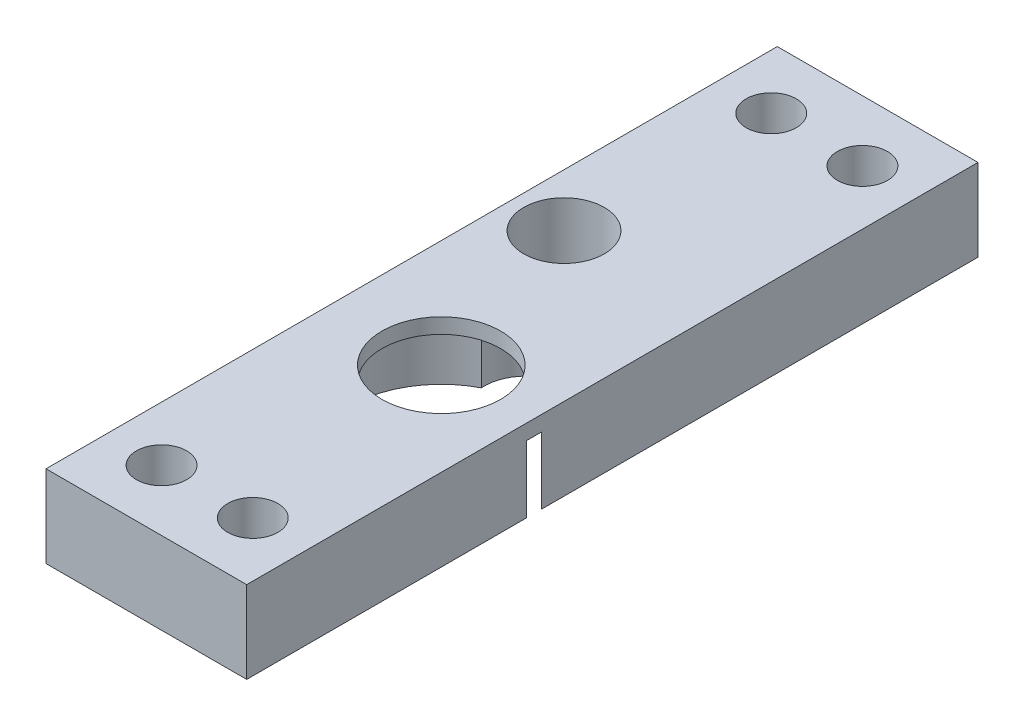
ISO-10303-21;
HEADER;
FILE_DESCRIPTION(('STEP AP214'),'2;1');
FILE_NAME('part.step','',(''),(''),'','','');
FILE_SCHEMA(('AUTOMOTIVE_DESIGN { 1 0 10303 214 1 1 1 1 }'));
ENDSEC;
DATA;
#1=APPLICATION_CONTEXT('core data for automotive mechanical design processes');
#2=APPLICATION_PROTOCOL_DEFINITION('international standard','automotive_design',2000,#1);
#3=PRODUCT_CONTEXT('',#1,'mechanical');
#4=PRODUCT('Part','Part','',(#3));
#5=PRODUCT_RELATED_PRODUCT_CATEGORY('part','',(#4));
#6=PRODUCT_DEFINITION_FORMATION('','',#4);
#7=PRODUCT_DEFINITION_CONTEXT('part definition',#1,'design');
#8=PRODUCT_DEFINITION('design','',#6,#7);
#9=PRODUCT_DEFINITION_SHAPE('','',#8);
#10=(LENGTH_UNIT() NAMED_UNIT(*) SI_UNIT(.MILLI.,.METRE.));
#11=(NAMED_UNIT(*) PLANE_ANGLE_UNIT() SI_UNIT($,.RADIAN.));
#12=(NAMED_UNIT(*) SI_UNIT($,.STERADIAN.) SOLID_ANGLE_UNIT());
#13=UNCERTAINTY_MEASURE_WITH_UNIT(LENGTH_MEASURE(1.E-05),#10,'distance_accuracy_value','');
#14=(GEOMETRIC_REPRESENTATION_CONTEXT(3) GLOBAL_UNCERTAINTY_ASSIGNED_CONTEXT((#13)) GLOBAL_UNIT_ASSIGNED_CONTEXT((#10,
#11,#12)) REPRESENTATION_CONTEXT('',''));
#15=CARTESIAN_POINT('',(0.,0.,0.));
#16=DIRECTION('',(0.,0.,1.));
#17=DIRECTION('',(1.,0.,0.));
#18=AXIS2_PLACEMENT_3D('',#15,#16,#17);
#19=CARTESIAN_POINT('',(2.47060611120811,0.4,-17.8));
#20=DIRECTION('',(0.,1.,0.));
#21=DIRECTION('',(0.,0.,1.));
#22=AXIS2_PLACEMENT_3D('',#19,#20,#21);
#23=CYLINDRICAL_SURFACE('',#22,2.65);
#24=CARTESIAN_POINT('',(2.47060611120811,0.4,-17.8));
#25=DIRECTION('',(0.,1.,0.));
#26=DIRECTION('',(0.,0.,1.));
#27=AXIS2_PLACEMENT_3D('',#24,#25,#26);
#28=CIRCLE('',#27,2.65);
#29=CARTESIAN_POINT('',(2.47060611120811,0.4,-15.15));
#30=VERTEX_POINT('',#29);
#31=EDGE_CURVE('E236',#30,#30,#28,.T.);
#32=ORIENTED_EDGE('',*,*,#31,.F.);
#33=EDGE_LOOP('',(#32));
#34=FACE_BOUND('',#33,.T.);
#35=CARTESIAN_POINT('',(2.47060611120811,5.4,-17.8));
#36=DIRECTION('',(0.,1.,0.));
#37=DIRECTION('',(0.,0.,1.));
#38=AXIS2_PLACEMENT_3D('',#35,#36,#37);
#39=CIRCLE('',#38,2.65);
#40=CARTESIAN_POINT('',(2.47060611120811,5.4,-15.15));
#41=VERTEX_POINT('',#40);
#42=EDGE_CURVE('E222',#41,#41,#39,.T.);
#43=ORIENTED_EDGE('',*,*,#42,.T.);
#44=EDGE_LOOP('',(#43));
#45=FACE_BOUND('',#44,.T.);
#46=ADVANCED_FACE('F47',(#34,#45),#23,.F.);
#47=CARTESIAN_POINT('',(2.47060611120811,0.4,-17.8));
#48=DIRECTION('',(0.,1.,0.));
#49=DIRECTION('',(0.,0.,1.));
#50=AXIS2_PLACEMENT_3D('',#47,#48,#49);
#51=PLANE('',#50);
#52=ORIENTED_EDGE('',*,*,#31,.T.);
#53=EDGE_LOOP('',(#52));
#54=FACE_BOUND('',#53,.T.);
#55=ADVANCED_FACE('F332',(#54),#51,.T.);
#56=CARTESIAN_POINT('',(0.,5.4,0.));
#57=DIRECTION('',(0.,1.,0.));
#58=DIRECTION('',(0.,0.,1.));
#59=AXIS2_PLACEMENT_3D('',#56,#57,#58);
#60=PLANE('',#59);
#61=ORIENTED_EDGE('',*,*,#42,.F.);
#62=EDGE_LOOP('',(#61));
#63=FACE_BOUND('',#62,.T.);
#64=DIRECTION('',(0.,0.,1.));
#65=VECTOR('',#64,1.);
#66=CARTESIAN_POINT('',(-1.,5.4,-27.3));
#67=LINE('',#66,#65);
#68=CARTESIAN_POINT('',(-1.,5.4,-35.3));
#69=VERTEX_POINT('',#68);
#70=CARTESIAN_POINT('',(-0.999999999999995,5.4,12.8));
#71=VERTEX_POINT('',#70);
#72=EDGE_CURVE('E230',#69,#71,#67,.T.);
#73=ORIENTED_EDGE('',*,*,#72,.T.);
#74=DIRECTION('',(1.,0.,0.));
#75=VECTOR('',#74,1.);
#76=CARTESIAN_POINT('',(-0.999999999999995,5.4,12.8));
#77=LINE('',#76,#75);
#78=CARTESIAN_POINT('',(12.2,5.4,12.8));
#79=VERTEX_POINT('',#78);
#80=EDGE_CURVE('E213',#71,#79,#77,.T.);
#81=ORIENTED_EDGE('',*,*,#80,.T.);
#82=DIRECTION('',(0.,0.,-1.));
#83=VECTOR('',#82,1.);
#84=CARTESIAN_POINT('',(12.2,5.4,-27.3));
#85=LINE('',#84,#83);
#86=CARTESIAN_POINT('',(12.2,5.4,-35.3));
#87=VERTEX_POINT('',#86);
#88=EDGE_CURVE('E181',#79,#87,#85,.T.);
#89=ORIENTED_EDGE('',*,*,#88,.T.);
#90=DIRECTION('',(-1.,0.,0.));
#91=VECTOR('',#90,1.);
#92=CARTESIAN_POINT('',(-1.,5.4,-35.3));
#93=LINE('',#92,#91);
#94=EDGE_CURVE('E284',#87,#69,#93,.T.);
#95=ORIENTED_EDGE('',*,*,#94,.T.);
#96=EDGE_LOOP('',(#73,#81,#89,#95));
#97=FACE_BOUND('',#96,.T.);
#98=CARTESIAN_POINT('',(6.1,5.4,-6.1));
#99=DIRECTION('',(0.,1.,0.));
#100=DIRECTION('',(0.,0.,1.));
#101=AXIS2_PLACEMENT_3D('',#98,#99,#100);
#102=CIRCLE('',#101,3.9);
#103=CARTESIAN_POINT('',(6.1,5.4,-2.2));
#104=VERTEX_POINT('',#103);
#105=EDGE_CURVE('E218',#104,#104,#102,.T.);
#106=ORIENTED_EDGE('',*,*,#105,.F.);
#107=EDGE_LOOP('',(#106));
#108=FACE_BOUND('',#107,.T.);
#109=CARTESIAN_POINT('',(2.6,5.4,8.8));
#110=DIRECTION('',(0.,1.,0.));
#111=DIRECTION('',(0.,0.,1.));
#112=AXIS2_PLACEMENT_3D('',#109,#110,#111);
#113=CIRCLE('',#112,1.65);
#114=CARTESIAN_POINT('',(2.6,5.4,10.45));
#115=VERTEX_POINT('',#114);
#116=EDGE_CURVE('E204',#115,#115,#113,.T.);
#117=ORIENTED_EDGE('',*,*,#116,.F.);
#118=EDGE_LOOP('',(#117));
#119=FACE_BOUND('',#118,.T.);
#120=CARTESIAN_POINT('',(8.6,5.4,8.8));
#121=DIRECTION('',(0.,1.,0.));
#122=DIRECTION('',(0.,0.,1.));
#123=AXIS2_PLACEMENT_3D('',#120,#121,#122);
#124=CIRCLE('',#123,1.65);
#125=CARTESIAN_POINT('',(8.6,5.4,10.45));
#126=VERTEX_POINT('',#125);
#127=EDGE_CURVE('E208',#126,#126,#124,.T.);
#128=ORIENTED_EDGE('',*,*,#127,.F.);
#129=EDGE_LOOP('',(#128));
#130=FACE_BOUND('',#129,.T.);
#131=CARTESIAN_POINT('',(2.6,5.4,-31.3));
#132=DIRECTION('',(0.,1.,0.));
#133=DIRECTION('',(0.,0.,1.));
#134=AXIS2_PLACEMENT_3D('',#131,#132,#133);
#135=CIRCLE('',#134,1.65);
#136=CARTESIAN_POINT('',(2.6,5.4,-29.65));
#137=VERTEX_POINT('',#136);
#138=EDGE_CURVE('E209',#137,#137,#135,.T.);
#139=ORIENTED_EDGE('',*,*,#138,.F.);
#140=EDGE_LOOP('',(#139));
#141=FACE_BOUND('',#140,.T.);
#142=CARTESIAN_POINT('',(8.6,5.4,-31.3));
#143=DIRECTION('',(0.,1.,0.));
#144=DIRECTION('',(0.,0.,1.));
#145=AXIS2_PLACEMENT_3D('',#142,#143,#144);
#146=CIRCLE('',#145,1.65);
#147=CARTESIAN_POINT('',(8.6,5.4,-29.65));
#148=VERTEX_POINT('',#147);
#149=EDGE_CURVE('E280',#148,#148,#146,.T.);
#150=ORIENTED_EDGE('',*,*,#149,.F.);
#151=EDGE_LOOP('',(#150));
#152=FACE_BOUND('',#151,.T.);
#153=ADVANCED_FACE('F302',(#63,#97,#108,#119,#130,#141,#152),#60,.T.);
#154=CARTESIAN_POINT('',(0.,4.4,0.));
#155=DIRECTION('',(0.,1.,0.));
#156=DIRECTION('',(0.,0.,1.));
#157=AXIS2_PLACEMENT_3D('',#154,#155,#156);
#158=PLANE('',#157);
#159=CARTESIAN_POINT('',(6.1,4.4,-6.1));
#160=DIRECTION('',(0.,1.,0.));
#161=DIRECTION('',(0.,0.,1.));
#162=AXIS2_PLACEMENT_3D('',#159,#160,#161);
#163=CIRCLE('',#162,6.1);
#164=CARTESIAN_POINT('',(12.1794736614283,4.4,-6.6));
#165=VERTEX_POINT('',#164);
#166=CARTESIAN_POINT('',(8.89435687149209,4.4,-11.5223214285714));
#167=VERTEX_POINT('',#166);
#168=EDGE_CURVE('E115',#165,#167,#163,.T.);
#169=ORIENTED_EDGE('',*,*,#168,.F.);
#170=DIRECTION('',(1.,0.,0.));
#171=VECTOR('',#170,1.);
#172=CARTESIAN_POINT('',(0.,4.4,-6.6));
#173=LINE('',#172,#171);
#174=CARTESIAN_POINT('',(12.2,4.4,-6.6));
#175=VERTEX_POINT('',#174);
#176=EDGE_CURVE('E119',#165,#175,#173,.T.);
#177=ORIENTED_EDGE('',*,*,#176,.T.);
#178=DIRECTION('',(0.,0.,-1.));
#179=VECTOR('',#178,1.);
#180=CARTESIAN_POINT('',(12.2,4.4,-27.3));
#181=LINE('',#180,#179);
#182=CARTESIAN_POINT('',(12.2,4.4,-5.6));
#183=VERTEX_POINT('',#182);
#184=EDGE_CURVE('E145',#183,#175,#181,.T.);
#185=ORIENTED_EDGE('',*,*,#184,.F.);
#186=DIRECTION('',(1.,0.,0.));
#187=VECTOR('',#186,1.);
#188=CARTESIAN_POINT('',(-2.36633811517809E-13,4.4,-5.59999999999948));
#189=LINE('',#188,#187);
#190=CARTESIAN_POINT('',(12.1794736614283,4.4,-5.6));
#191=VERTEX_POINT('',#190);
#192=EDGE_CURVE('E174',#191,#183,#189,.T.);
#193=ORIENTED_EDGE('',*,*,#192,.F.);
#194=CARTESIAN_POINT('',(6.1,4.4,-6.1));
#195=DIRECTION('',(0.,1.,0.));
#196=DIRECTION('',(0.,0.,1.));
#197=AXIS2_PLACEMENT_3D('',#194,#195,#196);
#198=CIRCLE('',#197,6.1);
#199=CARTESIAN_POINT('',(3.30564312850791,4.4,-11.5223214285714));
#200=VERTEX_POINT('',#199);
#201=EDGE_CURVE('E64',#200,#191,#198,.T.);
#202=ORIENTED_EDGE('',*,*,#201,.F.);
#203=CARTESIAN_POINT('',(6.1,4.4,-11.7));
#204=DIRECTION('',(0.,1.,0.));
#205=DIRECTION('',(0.,0.,1.));
#206=AXIS2_PLACEMENT_3D('',#203,#204,#205);
#207=CIRCLE('',#206,2.8);
#208=EDGE_CURVE('E92',#167,#200,#207,.T.);
#209=ORIENTED_EDGE('',*,*,#208,.F.);
#210=EDGE_LOOP('',(#169,#177,#185,#193,#202,#209));
#211=FACE_BOUND('',#210,.T.);
#212=CARTESIAN_POINT('',(6.1,4.4,-6.1));
#213=DIRECTION('',(0.,1.,0.));
#214=DIRECTION('',(0.,0.,1.));
#215=AXIS2_PLACEMENT_3D('',#212,#213,#214);
#216=CIRCLE('',#215,3.9);
#217=CARTESIAN_POINT('',(6.1,4.4,-2.2));
#218=VERTEX_POINT('',#217);
#219=EDGE_CURVE('E223',#218,#218,#216,.T.);
#220=ORIENTED_EDGE('',*,*,#219,.T.);
#221=EDGE_LOOP('',(#220));
#222=FACE_BOUND('',#221,.T.);
#223=ADVANCED_FACE('F320',(#211,#222),#158,.F.);
#224=CARTESIAN_POINT('',(6.1,5.4,-6.1));
#225=DIRECTION('',(0.,-1.,0.));
#226=DIRECTION('',(0.,0.,-1.));
#227=AXIS2_PLACEMENT_3D('',#224,#225,#226);
#228=CYLINDRICAL_SURFACE('',#227,3.9);
#229=ORIENTED_EDGE('',*,*,#105,.T.);
#230=EDGE_LOOP('',(#229));
#231=FACE_BOUND('',#230,.T.);
#232=ORIENTED_EDGE('',*,*,#219,.F.);
#233=EDGE_LOOP('',(#232));
#234=FACE_BOUND('',#233,.T.);
#235=ADVANCED_FACE('F260',(#231,#234),#228,.F.);
#236=CARTESIAN_POINT('',(0.,0.,0.));
#237=DIRECTION('',(0.,1.,0.));
#238=DIRECTION('',(0.,0.,1.));
#239=AXIS2_PLACEMENT_3D('',#236,#237,#238);
#240=PLANE('',#239);
#241=CARTESIAN_POINT('',(6.1,0.,-6.1));
#242=DIRECTION('',(0.,1.,0.));
#243=DIRECTION('',(0.,0.,1.));
#244=AXIS2_PLACEMENT_3D('',#241,#242,#243);
#245=CIRCLE('',#244,6.1);
#246=CARTESIAN_POINT('',(12.1794736614283,0.,-6.6));
#247=VERTEX_POINT('',#246);
#248=CARTESIAN_POINT('',(8.89435687149209,0.,-11.5223214285714));
#249=VERTEX_POINT('',#248);
#250=EDGE_CURVE('E113',#247,#249,#245,.T.);
#251=ORIENTED_EDGE('',*,*,#250,.T.);
#252=CARTESIAN_POINT('',(6.1,0.,-11.7));
#253=DIRECTION('',(0.,1.,0.));
#254=DIRECTION('',(0.,0.,1.));
#255=AXIS2_PLACEMENT_3D('',#252,#253,#254);
#256=CIRCLE('',#255,2.8);
#257=CARTESIAN_POINT('',(3.30564312850791,0.,-11.5223214285714));
#258=VERTEX_POINT('',#257);
#259=EDGE_CURVE('E91',#249,#258,#256,.T.);
#260=ORIENTED_EDGE('',*,*,#259,.T.);
#261=CARTESIAN_POINT('',(6.1,0.,-6.1));
#262=DIRECTION('',(0.,1.,0.));
#263=DIRECTION('',(0.,0.,1.));
#264=AXIS2_PLACEMENT_3D('',#261,#262,#263);
#265=CIRCLE('',#264,6.1);
#266=CARTESIAN_POINT('',(12.1794736614283,0.,-5.6));
#267=VERTEX_POINT('',#266);
#268=EDGE_CURVE('E99',#258,#267,#265,.T.);
#269=ORIENTED_EDGE('',*,*,#268,.T.);
#270=DIRECTION('',(1.,0.,0.));
#271=VECTOR('',#270,1.);
#272=CARTESIAN_POINT('',(-2.36633811517809E-13,0.,-5.59999999999948));
#273=LINE('',#272,#271);
#274=CARTESIAN_POINT('',(12.2,0.,-5.6));
#275=VERTEX_POINT('',#274);
#276=EDGE_CURVE('E106',#267,#275,#273,.T.);
#277=ORIENTED_EDGE('',*,*,#276,.T.);
#278=DIRECTION('',(0.,0.,-1.));
#279=VECTOR('',#278,1.);
#280=CARTESIAN_POINT('',(12.2,0.,0.));
#281=LINE('',#280,#279);
#282=CARTESIAN_POINT('',(12.2,0.,12.8));
#283=VERTEX_POINT('',#282);
#284=EDGE_CURVE('E158',#283,#275,#281,.T.);
#285=ORIENTED_EDGE('',*,*,#284,.F.);
#286=DIRECTION('',(-1.,0.,0.));
#287=VECTOR('',#286,1.);
#288=CARTESIAN_POINT('',(-0.999999999999995,0.,12.8));
#289=LINE('',#288,#287);
#290=CARTESIAN_POINT('',(-0.999999999999995,0.,12.8));
#291=VERTEX_POINT('',#290);
#292=EDGE_CURVE('E188',#283,#291,#289,.T.);
#293=ORIENTED_EDGE('',*,*,#292,.T.);
#294=DIRECTION('',(0.,0.,-1.));
#295=VECTOR('',#294,1.);
#296=CARTESIAN_POINT('',(-1.,0.,0.));
#297=LINE('',#296,#295);
#298=CARTESIAN_POINT('',(-1.,0.,-35.3));
#299=VERTEX_POINT('',#298);
#300=EDGE_CURVE('E154',#291,#299,#297,.T.);
#301=ORIENTED_EDGE('',*,*,#300,.T.);
#302=DIRECTION('',(1.,0.,0.));
#303=VECTOR('',#302,1.);
#304=CARTESIAN_POINT('',(-1.,0.,-35.3));
#305=LINE('',#304,#303);
#306=CARTESIAN_POINT('',(12.2,0.,-35.3));
#307=VERTEX_POINT('',#306);
#308=EDGE_CURVE('E151',#299,#307,#305,.T.);
#309=ORIENTED_EDGE('',*,*,#308,.T.);
#310=DIRECTION('',(0.,0.,-1.));
#311=VECTOR('',#310,1.);
#312=CARTESIAN_POINT('',(12.2,0.,0.));
#313=LINE('',#312,#311);
#314=CARTESIAN_POINT('',(12.2,0.,-6.6));
#315=VERTEX_POINT('',#314);
#316=EDGE_CURVE('E140',#315,#307,#313,.T.);
#317=ORIENTED_EDGE('',*,*,#316,.F.);
#318=DIRECTION('',(1.,0.,0.));
#319=VECTOR('',#318,1.);
#320=CARTESIAN_POINT('',(0.,0.,-6.6));
#321=LINE('',#320,#319);
#322=EDGE_CURVE('E148',#247,#315,#321,.T.);
#323=ORIENTED_EDGE('',*,*,#322,.F.);
#324=EDGE_LOOP('',(#251,#260,#269,#277,#285,#293,#301,#309,#317,#323));
#325=FACE_BOUND('',#324,.T.);
#326=CARTESIAN_POINT('',(2.6,0.,8.8));
#327=DIRECTION('',(0.,1.,0.));
#328=DIRECTION('',(0.,0.,1.));
#329=AXIS2_PLACEMENT_3D('',#326,#327,#328);
#330=CIRCLE('',#329,1.65);
#331=CARTESIAN_POINT('',(2.6,0.,10.45));
#332=VERTEX_POINT('',#331);
#333=EDGE_CURVE('E195',#332,#332,#330,.F.);
#334=ORIENTED_EDGE('',*,*,#333,.F.);
#335=EDGE_LOOP('',(#334));
#336=FACE_BOUND('',#335,.T.);
#337=CARTESIAN_POINT('',(8.6,0.,8.8));
#338=DIRECTION('',(0.,1.,0.));
#339=DIRECTION('',(0.,0.,1.));
#340=AXIS2_PLACEMENT_3D('',#337,#338,#339);
#341=CIRCLE('',#340,1.65);
#342=CARTESIAN_POINT('',(8.6,0.,10.45));
#343=VERTEX_POINT('',#342);
#344=EDGE_CURVE('E199',#343,#343,#341,.F.);
#345=ORIENTED_EDGE('',*,*,#344,.F.);
#346=EDGE_LOOP('',(#345));
#347=FACE_BOUND('',#346,.T.);
#348=CARTESIAN_POINT('',(2.6,0.,-31.3));
#349=DIRECTION('',(0.,1.,0.));
#350=DIRECTION('',(0.,0.,1.));
#351=AXIS2_PLACEMENT_3D('',#348,#349,#350);
#352=CIRCLE('',#351,1.65);
#353=CARTESIAN_POINT('',(2.6,0.,-29.65));
#354=VERTEX_POINT('',#353);
#355=EDGE_CURVE('E265',#354,#354,#352,.F.);
#356=ORIENTED_EDGE('',*,*,#355,.F.);
#357=EDGE_LOOP('',(#356));
#358=FACE_BOUND('',#357,.T.);
#359=CARTESIAN_POINT('',(8.6,0.,-31.3));
#360=DIRECTION('',(0.,1.,0.));
#361=DIRECTION('',(0.,0.,1.));
#362=AXIS2_PLACEMENT_3D('',#359,#360,#361);
#363=CIRCLE('',#362,1.65);
#364=CARTESIAN_POINT('',(8.6,0.,-29.65));
#365=VERTEX_POINT('',#364);
#366=EDGE_CURVE('E268',#365,#365,#363,.F.);
#367=ORIENTED_EDGE('',*,*,#366,.F.);
#368=EDGE_LOOP('',(#367));
#369=FACE_BOUND('',#368,.T.);
#370=ADVANCED_FACE('F109',(#325,#336,#347,#358,#369),#240,.F.);
#371=CARTESIAN_POINT('',(6.1,4.4,-11.7));
#372=DIRECTION('',(0.,-1.,0.));
#373=DIRECTION('',(0.,0.,-1.));
#374=AXIS2_PLACEMENT_3D('',#371,#372,#373);
#375=CYLINDRICAL_SURFACE('',#374,2.8);
#376=ORIENTED_EDGE('',*,*,#259,.F.);
#377=DIRECTION('',(0.,-1.,0.));
#378=VECTOR('',#377,1.);
#379=CARTESIAN_POINT('',(8.89435687149209,4.4,-11.5223214285714));
#380=LINE('',#379,#378);
#381=EDGE_CURVE('E96',#167,#249,#380,.T.);
#382=ORIENTED_EDGE('',*,*,#381,.F.);
#383=ORIENTED_EDGE('',*,*,#208,.T.);
#384=DIRECTION('',(0.,-1.,0.));
#385=VECTOR('',#384,1.);
#386=CARTESIAN_POINT('',(3.30564312850791,4.4,-11.5223214285714));
#387=LINE('',#386,#385);
#388=EDGE_CURVE('E86',#200,#258,#387,.T.);
#389=ORIENTED_EDGE('',*,*,#388,.T.);
#390=EDGE_LOOP('',(#376,#382,#383,#389));
#391=FACE_BOUND('',#390,.T.);
#392=ADVANCED_FACE('F88',(#391),#375,.F.);
#393=CARTESIAN_POINT('',(6.1,4.4,-6.1));
#394=DIRECTION('',(0.,-1.,0.));
#395=DIRECTION('',(0.,0.,-1.));
#396=AXIS2_PLACEMENT_3D('',#393,#394,#395);
#397=CYLINDRICAL_SURFACE('',#396,6.1);
#398=ORIENTED_EDGE('',*,*,#268,.F.);
#399=ORIENTED_EDGE('',*,*,#388,.F.);
#400=ORIENTED_EDGE('',*,*,#201,.T.);
#401=DIRECTION('',(0.,-1.,0.));
#402=VECTOR('',#401,1.);
#403=CARTESIAN_POINT('',(12.1794736614283,4.4,-5.6));
#404=LINE('',#403,#402);
#405=EDGE_CURVE('E95',#191,#267,#404,.T.);
#406=ORIENTED_EDGE('',*,*,#405,.T.);
#407=EDGE_LOOP('',(#398,#399,#400,#406));
#408=FACE_BOUND('',#407,.T.);
#409=ADVANCED_FACE('F100',(#408),#397,.F.);
#410=CARTESIAN_POINT('',(-2.36633811517809E-13,4.4,-5.59999999999948));
#411=DIRECTION('',(0.,0.,-1.));
#412=DIRECTION('',(-1.,0.,0.));
#413=AXIS2_PLACEMENT_3D('',#410,#411,#412);
#414=PLANE('',#413);
#415=ORIENTED_EDGE('',*,*,#276,.F.);
#416=ORIENTED_EDGE('',*,*,#405,.F.);
#417=ORIENTED_EDGE('',*,*,#192,.T.);
#418=DIRECTION('',(0.,-1.,0.));
#419=VECTOR('',#418,1.);
#420=CARTESIAN_POINT('',(12.2,4.4,-5.6));
#421=LINE('',#420,#419);
#422=EDGE_CURVE('E127',#183,#275,#421,.T.);
#423=ORIENTED_EDGE('',*,*,#422,.T.);
#424=EDGE_LOOP('',(#415,#416,#417,#423));
#425=FACE_BOUND('',#424,.T.);
#426=ADVANCED_FACE('F170',(#425),#414,.T.);
#427=CARTESIAN_POINT('',(0.,4.4,-6.6));
#428=DIRECTION('',(0.,0.,-1.));
#429=DIRECTION('',(-1.,0.,0.));
#430=AXIS2_PLACEMENT_3D('',#427,#428,#429);
#431=PLANE('',#430);
#432=ORIENTED_EDGE('',*,*,#322,.T.);
#433=DIRECTION('',(0.,-1.,0.));
#434=VECTOR('',#433,1.);
#435=CARTESIAN_POINT('',(12.2,4.4,-6.6));
#436=LINE('',#435,#434);
#437=EDGE_CURVE('E57',#175,#315,#436,.T.);
#438=ORIENTED_EDGE('',*,*,#437,.F.);
#439=ORIENTED_EDGE('',*,*,#176,.F.);
#440=DIRECTION('',(0.,-1.,0.));
#441=VECTOR('',#440,1.);
#442=CARTESIAN_POINT('',(12.1794736614283,4.4,-6.6));
#443=LINE('',#442,#441);
#444=EDGE_CURVE('E11',#165,#247,#443,.T.);
#445=ORIENTED_EDGE('',*,*,#444,.T.);
#446=EDGE_LOOP('',(#432,#438,#439,#445));
#447=FACE_BOUND('',#446,.T.);
#448=ADVANCED_FACE('F323',(#447),#431,.F.);
#449=CARTESIAN_POINT('',(6.1,4.4,-6.1));
#450=DIRECTION('',(0.,-1.,0.));
#451=DIRECTION('',(0.,0.,-1.));
#452=AXIS2_PLACEMENT_3D('',#449,#450,#451);
#453=CYLINDRICAL_SURFACE('',#452,6.1);
#454=ORIENTED_EDGE('',*,*,#250,.F.);
#455=ORIENTED_EDGE('',*,*,#444,.F.);
#456=ORIENTED_EDGE('',*,*,#168,.T.);
#457=ORIENTED_EDGE('',*,*,#381,.T.);
#458=EDGE_LOOP('',(#454,#455,#456,#457));
#459=FACE_BOUND('',#458,.T.);
#460=ADVANCED_FACE('F49',(#459),#453,.F.);
#461=CARTESIAN_POINT('',(12.2,4.4,0.));
#462=DIRECTION('',(-1.,0.,0.));
#463=DIRECTION('',(0.,0.,1.));
#464=AXIS2_PLACEMENT_3D('',#461,#462,#463);
#465=PLANE('',#464);
#466=ORIENTED_EDGE('',*,*,#284,.T.);
#467=ORIENTED_EDGE('',*,*,#422,.F.);
#468=ORIENTED_EDGE('',*,*,#184,.T.);
#469=ORIENTED_EDGE('',*,*,#437,.T.);
#470=ORIENTED_EDGE('',*,*,#316,.T.);
#471=DIRECTION('',(0.,1.,0.));
#472=VECTOR('',#471,1.);
#473=CARTESIAN_POINT('',(12.2,-15.4350251052598,-35.3));
#474=LINE('',#473,#472);
#475=EDGE_CURVE('E288',#307,#87,#474,.T.);
#476=ORIENTED_EDGE('',*,*,#475,.T.);
#477=ORIENTED_EDGE('',*,*,#88,.F.);
#478=DIRECTION('',(0.,1.,0.));
#479=VECTOR('',#478,1.);
#480=CARTESIAN_POINT('',(12.2,-15.4350251052598,12.8));
#481=LINE('',#480,#479);
#482=EDGE_CURVE('E177',#283,#79,#481,.T.);
#483=ORIENTED_EDGE('',*,*,#482,.F.);
#484=EDGE_LOOP('',(#466,#467,#468,#469,#470,#476,#477,#483));
#485=FACE_BOUND('',#484,.T.);
#486=ADVANCED_FACE('F137',(#485),#465,.F.);
#487=CARTESIAN_POINT('',(-1.,4.4,0.));
#488=DIRECTION('',(-1.,0.,0.));
#489=DIRECTION('',(0.,0.,1.));
#490=AXIS2_PLACEMENT_3D('',#487,#488,#489);
#491=PLANE('',#490);
#492=ORIENTED_EDGE('',*,*,#300,.F.);
#493=DIRECTION('',(0.,1.,0.));
#494=VECTOR('',#493,1.);
#495=CARTESIAN_POINT('',(-0.999999999999995,-15.4350251052598,12.8));
#496=LINE('',#495,#494);
#497=EDGE_CURVE('E189',#291,#71,#496,.T.);
#498=ORIENTED_EDGE('',*,*,#497,.T.);
#499=ORIENTED_EDGE('',*,*,#72,.F.);
#500=DIRECTION('',(0.,1.,0.));
#501=VECTOR('',#500,1.);
#502=CARTESIAN_POINT('',(-1.,-15.4350251052598,-35.3));
#503=LINE('',#502,#501);
#504=EDGE_CURVE('E276',#299,#69,#503,.T.);
#505=ORIENTED_EDGE('',*,*,#504,.F.);
#506=EDGE_LOOP('',(#492,#498,#499,#505));
#507=FACE_BOUND('',#506,.T.);
#508=ADVANCED_FACE('F350',(#507),#491,.T.);
#509=CARTESIAN_POINT('',(-0.999999999999995,-15.4350251052598,12.8));
#510=DIRECTION('',(0.,0.,1.));
#511=DIRECTION('',(1.,0.,0.));
#512=AXIS2_PLACEMENT_3D('',#509,#510,#511);
#513=PLANE('',#512);
#514=ORIENTED_EDGE('',*,*,#292,.F.);
#515=ORIENTED_EDGE('',*,*,#482,.T.);
#516=ORIENTED_EDGE('',*,*,#80,.F.);
#517=ORIENTED_EDGE('',*,*,#497,.F.);
#518=EDGE_LOOP('',(#514,#515,#516,#517));
#519=FACE_BOUND('',#518,.T.);
#520=ADVANCED_FACE('F192',(#519),#513,.T.);
#521=CARTESIAN_POINT('',(8.6,-15.4350251052598,8.8));
#522=DIRECTION('',(0.,1.,0.));
#523=DIRECTION('',(0.,0.,1.));
#524=AXIS2_PLACEMENT_3D('',#521,#522,#523);
#525=CYLINDRICAL_SURFACE('',#524,1.65);
#526=ORIENTED_EDGE('',*,*,#344,.T.);
#527=EDGE_LOOP('',(#526));
#528=FACE_BOUND('',#527,.T.);
#529=ORIENTED_EDGE('',*,*,#127,.T.);
#530=EDGE_LOOP('',(#529));
#531=FACE_BOUND('',#530,.T.);
#532=ADVANCED_FACE('F255',(#528,#531),#525,.F.);
#533=CARTESIAN_POINT('',(2.6,-15.4350251052598,8.8));
#534=DIRECTION('',(0.,1.,0.));
#535=DIRECTION('',(0.,0.,1.));
#536=AXIS2_PLACEMENT_3D('',#533,#534,#535);
#537=CYLINDRICAL_SURFACE('',#536,1.65);
#538=ORIENTED_EDGE('',*,*,#333,.T.);
#539=EDGE_LOOP('',(#538));
#540=FACE_BOUND('',#539,.T.);
#541=ORIENTED_EDGE('',*,*,#116,.T.);
#542=EDGE_LOOP('',(#541));
#543=FACE_BOUND('',#542,.T.);
#544=ADVANCED_FACE('F359',(#540,#543),#537,.F.);
#545=CARTESIAN_POINT('',(-1.,-15.4350251052598,-35.3));
#546=DIRECTION('',(0.,0.,-1.));
#547=DIRECTION('',(-1.,0.,0.));
#548=AXIS2_PLACEMENT_3D('',#545,#546,#547);
#549=PLANE('',#548);
#550=ORIENTED_EDGE('',*,*,#308,.F.);
#551=ORIENTED_EDGE('',*,*,#504,.T.);
#552=ORIENTED_EDGE('',*,*,#94,.F.);
#553=ORIENTED_EDGE('',*,*,#475,.F.);
#554=EDGE_LOOP('',(#550,#551,#552,#553));
#555=FACE_BOUND('',#554,.T.);
#556=ADVANCED_FACE('F299',(#555),#549,.T.);
#557=CARTESIAN_POINT('',(8.6,-15.4350251052598,-31.3));
#558=DIRECTION('',(0.,1.,0.));
#559=DIRECTION('',(0.,0.,1.));
#560=AXIS2_PLACEMENT_3D('',#557,#558,#559);
#561=CYLINDRICAL_SURFACE('',#560,1.65);
#562=ORIENTED_EDGE('',*,*,#366,.T.);
#563=EDGE_LOOP('',(#562));
#564=FACE_BOUND('',#563,.T.);
#565=ORIENTED_EDGE('',*,*,#149,.T.);
#566=EDGE_LOOP('',(#565));
#567=FACE_BOUND('',#566,.T.);
#568=ADVANCED_FACE('F488',(#564,#567),#561,.F.);
#569=CARTESIAN_POINT('',(2.6,-15.4350251052598,-31.3));
#570=DIRECTION('',(0.,1.,0.));
#571=DIRECTION('',(0.,0.,1.));
#572=AXIS2_PLACEMENT_3D('',#569,#570,#571);
#573=CYLINDRICAL_SURFACE('',#572,1.65);
#574=ORIENTED_EDGE('',*,*,#355,.T.);
#575=EDGE_LOOP('',(#574));
#576=FACE_BOUND('',#575,.T.);
#577=ORIENTED_EDGE('',*,*,#138,.T.);
#578=EDGE_LOOP('',(#577));
#579=FACE_BOUND('',#578,.T.);
#580=ADVANCED_FACE('F497',(#576,#579),#573,.F.);
#581=CLOSED_SHELL('',(#46,#55,#153,#223,#235,#370,#392,#409,#426,#448,#460,#486,#508,#520,#532,
#544,#556,#568,#580));
#582=MANIFOLD_SOLID_BREP('B2',#581);
#583=ADVANCED_BREP_SHAPE_REPRESENTATION('',(#18,#582),#14);
#584=SHAPE_DEFINITION_REPRESENTATION(#9,#583);
ENDSEC;
END-ISO-10303-21;
